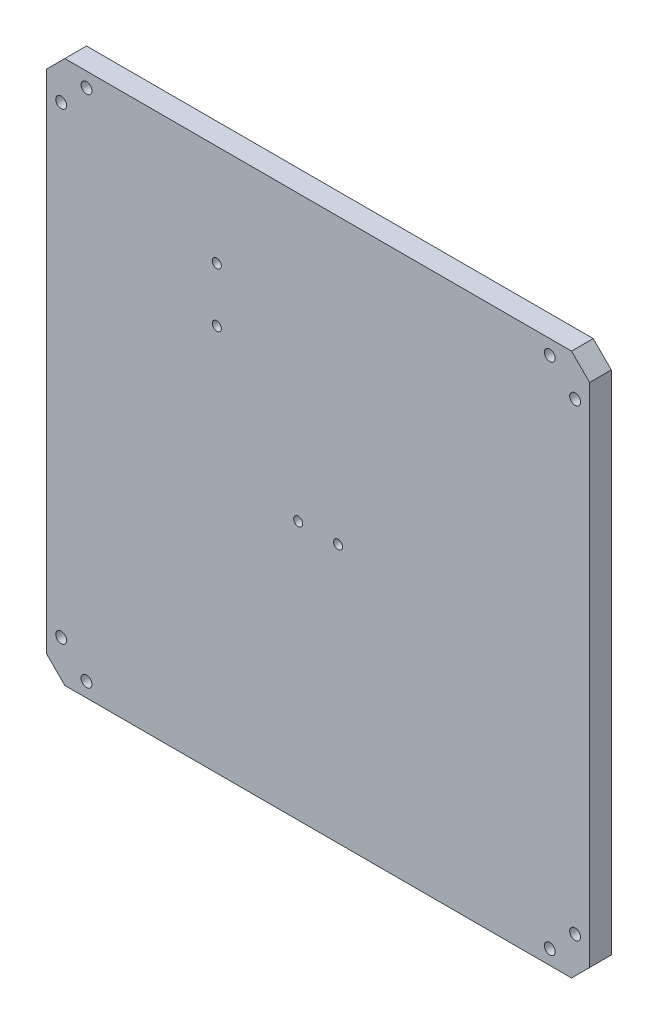
ISO-10303-21;
HEADER;
FILE_DESCRIPTION(('STEP AP214'),'2;1');
FILE_NAME('part.step','',(''),(''),'','','');
FILE_SCHEMA(('AUTOMOTIVE_DESIGN { 1 0 10303 214 1 1 1 1 }'));
ENDSEC;
DATA;
#1=APPLICATION_CONTEXT('core data for automotive mechanical design processes');
#2=APPLICATION_PROTOCOL_DEFINITION('international standard','automotive_design',2000,#1);
#3=PRODUCT_CONTEXT('',#1,'mechanical');
#4=PRODUCT('Part','Part','',(#3));
#5=PRODUCT_RELATED_PRODUCT_CATEGORY('part','',(#4));
#6=PRODUCT_DEFINITION_FORMATION('','',#4);
#7=PRODUCT_DEFINITION_CONTEXT('part definition',#1,'design');
#8=PRODUCT_DEFINITION('design','',#6,#7);
#9=PRODUCT_DEFINITION_SHAPE('','',#8);
#10=(LENGTH_UNIT() NAMED_UNIT(*) SI_UNIT(.MILLI.,.METRE.));
#11=(NAMED_UNIT(*) PLANE_ANGLE_UNIT() SI_UNIT($,.RADIAN.));
#12=(NAMED_UNIT(*) SI_UNIT($,.STERADIAN.) SOLID_ANGLE_UNIT());
#13=UNCERTAINTY_MEASURE_WITH_UNIT(LENGTH_MEASURE(1.E-05),#10,'distance_accuracy_value','');
#14=(GEOMETRIC_REPRESENTATION_CONTEXT(3) GLOBAL_UNCERTAINTY_ASSIGNED_CONTEXT((#13)) GLOBAL_UNIT_ASSIGNED_CONTEXT((#10,
#11,#12)) REPRESENTATION_CONTEXT('',''));
#15=CARTESIAN_POINT('',(0.,0.,0.));
#16=DIRECTION('',(0.,0.,1.));
#17=DIRECTION('',(1.,0.,0.));
#18=AXIS2_PLACEMENT_3D('',#15,#16,#17);
#19=CARTESIAN_POINT('',(-71.,-64.,-4.));
#20=DIRECTION('',(0.,0.,1.));
#21=DIRECTION('',(1.,0.,0.));
#22=AXIS2_PLACEMENT_3D('',#19,#20,#21);
#23=CYLINDRICAL_SURFACE('',#22,1.5);
#24=CARTESIAN_POINT('',(-71.,-64.,6.));
#25=DIRECTION('',(0.,0.,-1.));
#26=DIRECTION('',(-1.,0.,0.));
#27=AXIS2_PLACEMENT_3D('',#24,#25,#26);
#28=CIRCLE('',#27,1.5);
#29=CARTESIAN_POINT('',(-72.5,-64.,6.));
#30=VERTEX_POINT('',#29);
#31=EDGE_CURVE('E263',#30,#30,#28,.T.);
#32=ORIENTED_EDGE('',*,*,#31,.F.);
#33=EDGE_LOOP('',(#32));
#34=FACE_BOUND('',#33,.T.);
#35=CARTESIAN_POINT('',(-71.,-64.,3.2));
#36=DIRECTION('',(0.,0.,-1.));
#37=DIRECTION('',(-1.,0.,0.));
#38=AXIS2_PLACEMENT_3D('',#35,#36,#37);
#39=CIRCLE('',#38,1.5);
#40=CARTESIAN_POINT('',(-72.5,-64.,3.2));
#41=VERTEX_POINT('',#40);
#42=EDGE_CURVE('E217',#41,#41,#39,.T.);
#43=ORIENTED_EDGE('',*,*,#42,.T.);
#44=EDGE_LOOP('',(#43));
#45=FACE_BOUND('',#44,.T.);
#46=ADVANCED_FACE('F38',(#34,#45),#23,.F.);
#47=CARTESIAN_POINT('',(-64.,-71.,-4.));
#48=DIRECTION('',(0.,0.,1.));
#49=DIRECTION('',(1.,0.,0.));
#50=AXIS2_PLACEMENT_3D('',#47,#48,#49);
#51=CYLINDRICAL_SURFACE('',#50,1.5);
#52=CARTESIAN_POINT('',(-64.,-71.,6.));
#53=DIRECTION('',(0.,0.,-1.));
#54=DIRECTION('',(-1.,0.,0.));
#55=AXIS2_PLACEMENT_3D('',#52,#53,#54);
#56=CIRCLE('',#55,1.5);
#57=CARTESIAN_POINT('',(-65.5,-71.,6.));
#58=VERTEX_POINT('',#57);
#59=EDGE_CURVE('E204',#58,#58,#56,.T.);
#60=ORIENTED_EDGE('',*,*,#59,.F.);
#61=EDGE_LOOP('',(#60));
#62=FACE_BOUND('',#61,.T.);
#63=CARTESIAN_POINT('',(-64.,-71.,3.2));
#64=DIRECTION('',(0.,0.,-1.));
#65=DIRECTION('',(-1.,0.,0.));
#66=AXIS2_PLACEMENT_3D('',#63,#64,#65);
#67=CIRCLE('',#66,1.5);
#68=CARTESIAN_POINT('',(-65.5,-71.,3.2));
#69=VERTEX_POINT('',#68);
#70=EDGE_CURVE('E212',#69,#69,#67,.T.);
#71=ORIENTED_EDGE('',*,*,#70,.T.);
#72=EDGE_LOOP('',(#71));
#73=FACE_BOUND('',#72,.T.);
#74=ADVANCED_FACE('F346',(#62,#73),#51,.F.);
#75=CARTESIAN_POINT('',(71.,-64.,-4.));
#76=DIRECTION('',(0.,0.,1.));
#77=DIRECTION('',(1.,0.,0.));
#78=AXIS2_PLACEMENT_3D('',#75,#76,#77);
#79=CYLINDRICAL_SURFACE('',#78,1.5);
#80=CARTESIAN_POINT('',(71.,-64.,6.));
#81=DIRECTION('',(0.,0.,-1.));
#82=DIRECTION('',(1.,0.,0.));
#83=AXIS2_PLACEMENT_3D('',#80,#81,#82);
#84=CIRCLE('',#83,1.5);
#85=CARTESIAN_POINT('',(72.5,-64.,6.));
#86=VERTEX_POINT('',#85);
#87=EDGE_CURVE('E259',#86,#86,#84,.T.);
#88=ORIENTED_EDGE('',*,*,#87,.F.);
#89=EDGE_LOOP('',(#88));
#90=FACE_BOUND('',#89,.T.);
#91=CARTESIAN_POINT('',(71.,-64.,3.2));
#92=DIRECTION('',(0.,0.,-1.));
#93=DIRECTION('',(-1.,0.,0.));
#94=AXIS2_PLACEMENT_3D('',#91,#92,#93);
#95=CIRCLE('',#94,1.5);
#96=CARTESIAN_POINT('',(69.5,-64.,3.2));
#97=VERTEX_POINT('',#96);
#98=EDGE_CURVE('E206',#97,#97,#95,.T.);
#99=ORIENTED_EDGE('',*,*,#98,.T.);
#100=EDGE_LOOP('',(#99));
#101=FACE_BOUND('',#100,.T.);
#102=ADVANCED_FACE('F352',(#90,#101),#79,.F.);
#103=CARTESIAN_POINT('',(64.,-71.,-4.));
#104=DIRECTION('',(0.,0.,1.));
#105=DIRECTION('',(1.,0.,0.));
#106=AXIS2_PLACEMENT_3D('',#103,#104,#105);
#107=CYLINDRICAL_SURFACE('',#106,1.5);
#108=CARTESIAN_POINT('',(64.,-71.,6.));
#109=DIRECTION('',(0.,0.,-1.));
#110=DIRECTION('',(1.,0.,0.));
#111=AXIS2_PLACEMENT_3D('',#108,#109,#110);
#112=CIRCLE('',#111,1.5);
#113=CARTESIAN_POINT('',(65.5,-71.,6.));
#114=VERTEX_POINT('',#113);
#115=EDGE_CURVE('E262',#114,#114,#112,.T.);
#116=ORIENTED_EDGE('',*,*,#115,.F.);
#117=EDGE_LOOP('',(#116));
#118=FACE_BOUND('',#117,.T.);
#119=CARTESIAN_POINT('',(64.,-71.,3.2));
#120=DIRECTION('',(0.,0.,-1.));
#121=DIRECTION('',(-1.,0.,0.));
#122=AXIS2_PLACEMENT_3D('',#119,#120,#121);
#123=CIRCLE('',#122,1.5);
#124=CARTESIAN_POINT('',(62.5,-71.,3.2));
#125=VERTEX_POINT('',#124);
#126=EDGE_CURVE('E200',#125,#125,#123,.T.);
#127=ORIENTED_EDGE('',*,*,#126,.T.);
#128=EDGE_LOOP('',(#127));
#129=FACE_BOUND('',#128,.T.);
#130=ADVANCED_FACE('F359',(#118,#129),#107,.F.);
#131=CARTESIAN_POINT('',(71.,64.,-4.));
#132=DIRECTION('',(0.,0.,1.));
#133=DIRECTION('',(1.,0.,0.));
#134=AXIS2_PLACEMENT_3D('',#131,#132,#133);
#135=CYLINDRICAL_SURFACE('',#134,1.5);
#136=CARTESIAN_POINT('',(71.,64.,6.));
#137=DIRECTION('',(0.,0.,1.));
#138=DIRECTION('',(1.,0.,0.));
#139=AXIS2_PLACEMENT_3D('',#136,#137,#138);
#140=CIRCLE('',#139,1.5);
#141=CARTESIAN_POINT('',(72.5,64.,6.));
#142=VERTEX_POINT('',#141);
#143=EDGE_CURVE('E295',#142,#142,#140,.T.);
#144=ORIENTED_EDGE('',*,*,#143,.T.);
#145=EDGE_LOOP('',(#144));
#146=FACE_BOUND('',#145,.T.);
#147=CARTESIAN_POINT('',(71.,64.,3.2));
#148=DIRECTION('',(0.,0.,-1.));
#149=DIRECTION('',(-1.,0.,0.));
#150=AXIS2_PLACEMENT_3D('',#147,#148,#149);
#151=CIRCLE('',#150,1.5);
#152=CARTESIAN_POINT('',(69.5,64.,3.2));
#153=VERTEX_POINT('',#152);
#154=EDGE_CURVE('E194',#153,#153,#151,.F.);
#155=ORIENTED_EDGE('',*,*,#154,.F.);
#156=EDGE_LOOP('',(#155));
#157=FACE_BOUND('',#156,.T.);
#158=ADVANCED_FACE('F362',(#146,#157),#135,.F.);
#159=CARTESIAN_POINT('',(64.,71.,-4.));
#160=DIRECTION('',(0.,0.,1.));
#161=DIRECTION('',(1.,0.,0.));
#162=AXIS2_PLACEMENT_3D('',#159,#160,#161);
#163=CYLINDRICAL_SURFACE('',#162,1.5);
#164=CARTESIAN_POINT('',(64.,71.,6.));
#165=DIRECTION('',(0.,0.,1.));
#166=DIRECTION('',(1.,0.,0.));
#167=AXIS2_PLACEMENT_3D('',#164,#165,#166);
#168=CIRCLE('',#167,1.5);
#169=CARTESIAN_POINT('',(65.5,71.,6.));
#170=VERTEX_POINT('',#169);
#171=EDGE_CURVE('E298',#170,#170,#168,.T.);
#172=ORIENTED_EDGE('',*,*,#171,.T.);
#173=EDGE_LOOP('',(#172));
#174=FACE_BOUND('',#173,.T.);
#175=CARTESIAN_POINT('',(64.,71.,3.2));
#176=DIRECTION('',(0.,0.,-1.));
#177=DIRECTION('',(-1.,0.,0.));
#178=AXIS2_PLACEMENT_3D('',#175,#176,#177);
#179=CIRCLE('',#178,1.5);
#180=CARTESIAN_POINT('',(62.5,71.,3.2));
#181=VERTEX_POINT('',#180);
#182=EDGE_CURVE('E188',#181,#181,#179,.F.);
#183=ORIENTED_EDGE('',*,*,#182,.F.);
#184=EDGE_LOOP('',(#183));
#185=FACE_BOUND('',#184,.T.);
#186=ADVANCED_FACE('F399',(#174,#185),#163,.F.);
#187=CARTESIAN_POINT('',(-71.,64.,-4.));
#188=DIRECTION('',(0.,0.,1.));
#189=DIRECTION('',(1.,0.,0.));
#190=AXIS2_PLACEMENT_3D('',#187,#188,#189);
#191=CYLINDRICAL_SURFACE('',#190,1.5);
#192=CARTESIAN_POINT('',(-71.,64.,6.));
#193=DIRECTION('',(0.,0.,1.));
#194=DIRECTION('',(-1.,0.,0.));
#195=AXIS2_PLACEMENT_3D('',#192,#193,#194);
#196=CIRCLE('',#195,1.5);
#197=CARTESIAN_POINT('',(-72.5,64.,6.));
#198=VERTEX_POINT('',#197);
#199=EDGE_CURVE('E299',#198,#198,#196,.T.);
#200=ORIENTED_EDGE('',*,*,#199,.T.);
#201=EDGE_LOOP('',(#200));
#202=FACE_BOUND('',#201,.T.);
#203=CARTESIAN_POINT('',(-71.,64.,3.2));
#204=DIRECTION('',(0.,0.,-1.));
#205=DIRECTION('',(-1.,0.,0.));
#206=AXIS2_PLACEMENT_3D('',#203,#204,#205);
#207=CIRCLE('',#206,1.5);
#208=CARTESIAN_POINT('',(-72.5,64.,3.2));
#209=VERTEX_POINT('',#208);
#210=EDGE_CURVE('E182',#209,#209,#207,.F.);
#211=ORIENTED_EDGE('',*,*,#210,.F.);
#212=EDGE_LOOP('',(#211));
#213=FACE_BOUND('',#212,.T.);
#214=ADVANCED_FACE('F401',(#202,#213),#191,.F.);
#215=CARTESIAN_POINT('',(-64.,71.,-4.));
#216=DIRECTION('',(0.,0.,1.));
#217=DIRECTION('',(1.,0.,0.));
#218=AXIS2_PLACEMENT_3D('',#215,#216,#217);
#219=CYLINDRICAL_SURFACE('',#218,1.5);
#220=CARTESIAN_POINT('',(-64.,71.,6.));
#221=DIRECTION('',(0.,0.,1.));
#222=DIRECTION('',(-1.,0.,0.));
#223=AXIS2_PLACEMENT_3D('',#220,#221,#222);
#224=CIRCLE('',#223,1.5);
#225=CARTESIAN_POINT('',(-65.5,71.,6.));
#226=VERTEX_POINT('',#225);
#227=EDGE_CURVE('E180',#226,#226,#224,.T.);
#228=ORIENTED_EDGE('',*,*,#227,.T.);
#229=EDGE_LOOP('',(#228));
#230=FACE_BOUND('',#229,.T.);
#231=CARTESIAN_POINT('',(-64.,71.,3.2));
#232=DIRECTION('',(0.,0.,-1.));
#233=DIRECTION('',(-1.,0.,0.));
#234=AXIS2_PLACEMENT_3D('',#231,#232,#233);
#235=CIRCLE('',#234,1.5);
#236=CARTESIAN_POINT('',(-65.5,71.,3.2));
#237=VERTEX_POINT('',#236);
#238=EDGE_CURVE('E176',#237,#237,#235,.F.);
#239=ORIENTED_EDGE('',*,*,#238,.F.);
#240=EDGE_LOOP('',(#239));
#241=FACE_BOUND('',#240,.T.);
#242=ADVANCED_FACE('F343',(#230,#241),#219,.F.);
#243=CARTESIAN_POINT('',(-75.,-75.,6.));
#244=DIRECTION('',(1.,0.,0.));
#245=DIRECTION('',(0.,0.,-1.));
#246=AXIS2_PLACEMENT_3D('',#243,#244,#245);
#247=PLANE('',#246);
#248=DIRECTION('',(0.,-1.,0.));
#249=VECTOR('',#248,1.);
#250=CARTESIAN_POINT('',(-75.,-75.,0.));
#251=LINE('',#250,#249);
#252=CARTESIAN_POINT('',(-75.,70.,0.));
#253=VERTEX_POINT('',#252);
#254=CARTESIAN_POINT('',(-75.,-70.,0.));
#255=VERTEX_POINT('',#254);
#256=EDGE_CURVE('E142',#253,#255,#251,.T.);
#257=ORIENTED_EDGE('',*,*,#256,.T.);
#258=DIRECTION('',(0.,0.,1.));
#259=VECTOR('',#258,1.);
#260=CARTESIAN_POINT('',(-75.,-70.,6.));
#261=LINE('',#260,#259);
#262=CARTESIAN_POINT('',(-75.,-70.,6.));
#263=VERTEX_POINT('',#262);
#264=EDGE_CURVE('E172',#255,#263,#261,.T.);
#265=ORIENTED_EDGE('',*,*,#264,.T.);
#266=DIRECTION('',(0.,-1.,0.));
#267=VECTOR('',#266,1.);
#268=CARTESIAN_POINT('',(-75.,-75.,6.));
#269=LINE('',#268,#267);
#270=CARTESIAN_POINT('',(-75.,70.,6.));
#271=VERTEX_POINT('',#270);
#272=EDGE_CURVE('E139',#271,#263,#269,.T.);
#273=ORIENTED_EDGE('',*,*,#272,.F.);
#274=DIRECTION('',(0.,0.,-1.));
#275=VECTOR('',#274,1.);
#276=CARTESIAN_POINT('',(-75.,70.,6.));
#277=LINE('',#276,#275);
#278=EDGE_CURVE('E169',#271,#253,#277,.T.);
#279=ORIENTED_EDGE('',*,*,#278,.T.);
#280=EDGE_LOOP('',(#257,#265,#273,#279));
#281=FACE_BOUND('',#280,.T.);
#282=ADVANCED_FACE('F324',(#281),#247,.F.);
#283=CARTESIAN_POINT('',(75.,-75.,6.));
#284=DIRECTION('',(0.,1.,0.));
#285=DIRECTION('',(-1.,0.,0.));
#286=AXIS2_PLACEMENT_3D('',#283,#284,#285);
#287=PLANE('',#286);
#288=DIRECTION('',(1.,0.,0.));
#289=VECTOR('',#288,1.);
#290=CARTESIAN_POINT('',(75.,-75.,0.));
#291=LINE('',#290,#289);
#292=CARTESIAN_POINT('',(-70.0000000000001,-75.,0.));
#293=VERTEX_POINT('',#292);
#294=CARTESIAN_POINT('',(70.,-75.,0.));
#295=VERTEX_POINT('',#294);
#296=EDGE_CURVE('E133',#293,#295,#291,.T.);
#297=ORIENTED_EDGE('',*,*,#296,.T.);
#298=DIRECTION('',(0.,0.,1.));
#299=VECTOR('',#298,1.);
#300=CARTESIAN_POINT('',(70.,-75.,6.));
#301=LINE('',#300,#299);
#302=CARTESIAN_POINT('',(70.,-75.,6.));
#303=VERTEX_POINT('',#302);
#304=EDGE_CURVE('E110',#295,#303,#301,.T.);
#305=ORIENTED_EDGE('',*,*,#304,.T.);
#306=DIRECTION('',(1.,0.,0.));
#307=VECTOR('',#306,1.);
#308=CARTESIAN_POINT('',(75.,-75.,6.));
#309=LINE('',#308,#307);
#310=CARTESIAN_POINT('',(-70.0000000000001,-75.,6.));
#311=VERTEX_POINT('',#310);
#312=EDGE_CURVE('E310',#311,#303,#309,.T.);
#313=ORIENTED_EDGE('',*,*,#312,.F.);
#314=DIRECTION('',(0.,0.,-1.));
#315=VECTOR('',#314,1.);
#316=CARTESIAN_POINT('',(-70.0000000000001,-75.,6.));
#317=LINE('',#316,#315);
#318=EDGE_CURVE('E116',#311,#293,#317,.T.);
#319=ORIENTED_EDGE('',*,*,#318,.T.);
#320=EDGE_LOOP('',(#297,#305,#313,#319));
#321=FACE_BOUND('',#320,.T.);
#322=ADVANCED_FACE('F334',(#321),#287,.F.);
#323=CARTESIAN_POINT('',(75.,-75.,6.));
#324=DIRECTION('',(-1.,0.,0.));
#325=DIRECTION('',(0.,0.,1.));
#326=AXIS2_PLACEMENT_3D('',#323,#324,#325);
#327=PLANE('',#326);
#328=DIRECTION('',(0.,1.,0.));
#329=VECTOR('',#328,1.);
#330=CARTESIAN_POINT('',(75.,-75.,6.));
#331=LINE('',#330,#329);
#332=CARTESIAN_POINT('',(75.,-70.,6.));
#333=VERTEX_POINT('',#332);
#334=CARTESIAN_POINT('',(75.,70.,6.));
#335=VERTEX_POINT('',#334);
#336=EDGE_CURVE('E125',#333,#335,#331,.T.);
#337=ORIENTED_EDGE('',*,*,#336,.F.);
#338=DIRECTION('',(0.,0.,-1.));
#339=VECTOR('',#338,1.);
#340=CARTESIAN_POINT('',(75.,-70.,6.));
#341=LINE('',#340,#339);
#342=CARTESIAN_POINT('',(75.,-70.,0.));
#343=VERTEX_POINT('',#342);
#344=EDGE_CURVE('E109',#333,#343,#341,.T.);
#345=ORIENTED_EDGE('',*,*,#344,.T.);
#346=DIRECTION('',(0.,1.,0.));
#347=VECTOR('',#346,1.);
#348=CARTESIAN_POINT('',(75.,-75.,0.));
#349=LINE('',#348,#347);
#350=CARTESIAN_POINT('',(75.,70.,0.));
#351=VERTEX_POINT('',#350);
#352=EDGE_CURVE('E123',#343,#351,#349,.T.);
#353=ORIENTED_EDGE('',*,*,#352,.T.);
#354=DIRECTION('',(0.,0.,1.));
#355=VECTOR('',#354,1.);
#356=CARTESIAN_POINT('',(75.,70.,6.));
#357=LINE('',#356,#355);
#358=EDGE_CURVE('E127',#351,#335,#357,.T.);
#359=ORIENTED_EDGE('',*,*,#358,.T.);
#360=EDGE_LOOP('',(#337,#345,#353,#359));
#361=FACE_BOUND('',#360,.T.);
#362=ADVANCED_FACE('F122',(#361),#327,.F.);
#363=CARTESIAN_POINT('',(75.,75.,6.));
#364=DIRECTION('',(0.,-1.,0.));
#365=DIRECTION('',(1.,0.,0.));
#366=AXIS2_PLACEMENT_3D('',#363,#364,#365);
#367=PLANE('',#366);
#368=DIRECTION('',(-1.,0.,0.));
#369=VECTOR('',#368,1.);
#370=CARTESIAN_POINT('',(75.,75.,0.));
#371=LINE('',#370,#369);
#372=CARTESIAN_POINT('',(70.,75.,0.));
#373=VERTEX_POINT('',#372);
#374=CARTESIAN_POINT('',(-70.,75.,0.));
#375=VERTEX_POINT('',#374);
#376=EDGE_CURVE('E132',#373,#375,#371,.T.);
#377=ORIENTED_EDGE('',*,*,#376,.T.);
#378=DIRECTION('',(0.,0.,1.));
#379=VECTOR('',#378,1.);
#380=CARTESIAN_POINT('',(-70.,75.,6.));
#381=LINE('',#380,#379);
#382=CARTESIAN_POINT('',(-70.,75.,6.));
#383=VERTEX_POINT('',#382);
#384=EDGE_CURVE('E11',#375,#383,#381,.T.);
#385=ORIENTED_EDGE('',*,*,#384,.T.);
#386=DIRECTION('',(-1.,0.,0.));
#387=VECTOR('',#386,1.);
#388=CARTESIAN_POINT('',(75.,75.,6.));
#389=LINE('',#388,#387);
#390=CARTESIAN_POINT('',(70.,75.,6.));
#391=VERTEX_POINT('',#390);
#392=EDGE_CURVE('E146',#391,#383,#389,.T.);
#393=ORIENTED_EDGE('',*,*,#392,.F.);
#394=DIRECTION('',(0.,0.,-1.));
#395=VECTOR('',#394,1.);
#396=CARTESIAN_POINT('',(70.,75.,6.));
#397=LINE('',#396,#395);
#398=EDGE_CURVE('E47',#391,#373,#397,.T.);
#399=ORIENTED_EDGE('',*,*,#398,.T.);
#400=EDGE_LOOP('',(#377,#385,#393,#399));
#401=FACE_BOUND('',#400,.T.);
#402=ADVANCED_FACE('F341',(#401),#367,.F.);
#403=CARTESIAN_POINT('',(0.,0.,6.));
#404=DIRECTION('',(0.,0.,1.));
#405=DIRECTION('',(1.,0.,0.));
#406=AXIS2_PLACEMENT_3D('',#403,#404,#405);
#407=PLANE('',#406);
#408=CARTESIAN_POINT('',(-28.,47.,6.));
#409=DIRECTION('',(0.,0.,1.));
#410=DIRECTION('',(1.,0.,0.));
#411=AXIS2_PLACEMENT_3D('',#408,#409,#410);
#412=CIRCLE('',#411,1.24999999999999);
#413=CARTESIAN_POINT('',(-26.75,47.,6.));
#414=VERTEX_POINT('',#413);
#415=EDGE_CURVE('E747',#414,#414,#412,.T.);
#416=ORIENTED_EDGE('',*,*,#415,.F.);
#417=EDGE_LOOP('',(#416));
#418=FACE_BOUND('',#417,.T.);
#419=CARTESIAN_POINT('',(-28.,32.,6.));
#420=DIRECTION('',(0.,0.,1.));
#421=DIRECTION('',(1.,0.,0.));
#422=AXIS2_PLACEMENT_3D('',#419,#420,#421);
#423=CIRCLE('',#422,1.24999999999999);
#424=CARTESIAN_POINT('',(-26.75,32.,6.));
#425=VERTEX_POINT('',#424);
#426=EDGE_CURVE('E723',#425,#425,#423,.T.);
#427=ORIENTED_EDGE('',*,*,#426,.F.);
#428=EDGE_LOOP('',(#427));
#429=FACE_BOUND('',#428,.T.);
#430=CARTESIAN_POINT('',(-5.50000000000001,-3.49999999999997,6.));
#431=DIRECTION('',(0.,0.,1.));
#432=DIRECTION('',(1.,0.,0.));
#433=AXIS2_PLACEMENT_3D('',#430,#431,#432);
#434=CIRCLE('',#433,1.24999999999999);
#435=CARTESIAN_POINT('',(-4.25000000000002,-3.49999999999997,6.));
#436=VERTEX_POINT('',#435);
#437=EDGE_CURVE('E722',#436,#436,#434,.T.);
#438=ORIENTED_EDGE('',*,*,#437,.F.);
#439=EDGE_LOOP('',(#438));
#440=FACE_BOUND('',#439,.T.);
#441=CARTESIAN_POINT('',(5.49999999999999,-3.49999999999997,6.));
#442=DIRECTION('',(0.,0.,1.));
#443=DIRECTION('',(1.,0.,0.));
#444=AXIS2_PLACEMENT_3D('',#441,#442,#443);
#445=CIRCLE('',#444,1.24999999999999);
#446=CARTESIAN_POINT('',(6.74999999999998,-3.49999999999997,6.));
#447=VERTEX_POINT('',#446);
#448=EDGE_CURVE('E733',#447,#447,#445,.T.);
#449=ORIENTED_EDGE('',*,*,#448,.F.);
#450=EDGE_LOOP('',(#449));
#451=FACE_BOUND('',#450,.T.);
#452=ORIENTED_EDGE('',*,*,#87,.T.);
#453=EDGE_LOOP('',(#452));
#454=FACE_BOUND('',#453,.T.);
#455=ORIENTED_EDGE('',*,*,#31,.T.);
#456=EDGE_LOOP('',(#455));
#457=FACE_BOUND('',#456,.T.);
#458=ORIENTED_EDGE('',*,*,#59,.T.);
#459=EDGE_LOOP('',(#458));
#460=FACE_BOUND('',#459,.T.);
#461=ORIENTED_EDGE('',*,*,#115,.T.);
#462=EDGE_LOOP('',(#461));
#463=FACE_BOUND('',#462,.T.);
#464=ORIENTED_EDGE('',*,*,#143,.F.);
#465=EDGE_LOOP('',(#464));
#466=FACE_BOUND('',#465,.T.);
#467=ORIENTED_EDGE('',*,*,#199,.F.);
#468=EDGE_LOOP('',(#467));
#469=FACE_BOUND('',#468,.T.);
#470=ORIENTED_EDGE('',*,*,#227,.F.);
#471=EDGE_LOOP('',(#470));
#472=FACE_BOUND('',#471,.T.);
#473=ORIENTED_EDGE('',*,*,#171,.F.);
#474=EDGE_LOOP('',(#473));
#475=FACE_BOUND('',#474,.T.);
#476=ORIENTED_EDGE('',*,*,#312,.T.);
#477=DIRECTION('',(-0.707106781186549,-0.707106781186546,0.));
#478=VECTOR('',#477,1.);
#479=CARTESIAN_POINT('',(72.4999999999998,-72.5000000000002,6.));
#480=LINE('',#479,#478);
#481=EDGE_CURVE('E167',#303,#333,#480,.F.);
#482=ORIENTED_EDGE('',*,*,#481,.T.);
#483=ORIENTED_EDGE('',*,*,#336,.T.);
#484=DIRECTION('',(0.707106781186548,-0.707106781186548,0.));
#485=VECTOR('',#484,1.);
#486=CARTESIAN_POINT('',(72.5,72.5,6.));
#487=LINE('',#486,#485);
#488=EDGE_CURVE('E60',#335,#391,#487,.F.);
#489=ORIENTED_EDGE('',*,*,#488,.T.);
#490=ORIENTED_EDGE('',*,*,#392,.T.);
#491=DIRECTION('',(0.707106781186549,0.707106781186547,0.));
#492=VECTOR('',#491,1.);
#493=CARTESIAN_POINT('',(-72.4999999999999,72.5000000000001,6.));
#494=LINE('',#493,#492);
#495=EDGE_CURVE('E161',#383,#271,#494,.F.);
#496=ORIENTED_EDGE('',*,*,#495,.T.);
#497=ORIENTED_EDGE('',*,*,#272,.T.);
#498=DIRECTION('',(-0.707106781186548,0.707106781186548,0.));
#499=VECTOR('',#498,1.);
#500=CARTESIAN_POINT('',(-72.5,-72.5,6.));
#501=LINE('',#500,#499);
#502=EDGE_CURVE('E164',#263,#311,#501,.F.);
#503=ORIENTED_EDGE('',*,*,#502,.T.);
#504=EDGE_LOOP('',(#476,#482,#483,#489,#490,#496,#497,#503));
#505=FACE_BOUND('',#504,.T.);
#506=ADVANCED_FACE('F332',(#418,#429,#440,#451,#454,#457,#460,#463,#466,#469,#472,#475,#505),
#407,.T.);
#507=CARTESIAN_POINT('',(0.,0.,0.));
#508=DIRECTION('',(0.,0.,1.));
#509=DIRECTION('',(1.,0.,0.));
#510=AXIS2_PLACEMENT_3D('',#507,#508,#509);
#511=PLANE('',#510);
#512=CARTESIAN_POINT('',(-28.,47.,0.));
#513=DIRECTION('',(0.,0.,1.));
#514=DIRECTION('',(1.,0.,0.));
#515=AXIS2_PLACEMENT_3D('',#512,#513,#514);
#516=CIRCLE('',#515,1.24999999999999);
#517=CARTESIAN_POINT('',(-26.75,47.,0.));
#518=VERTEX_POINT('',#517);
#519=EDGE_CURVE('E42',#518,#518,#516,.T.);
#520=ORIENTED_EDGE('',*,*,#519,.T.);
#521=EDGE_LOOP('',(#520));
#522=FACE_BOUND('',#521,.T.);
#523=CARTESIAN_POINT('',(-28.,32.,0.));
#524=DIRECTION('',(0.,0.,1.));
#525=DIRECTION('',(1.,0.,0.));
#526=AXIS2_PLACEMENT_3D('',#523,#524,#525);
#527=CIRCLE('',#526,1.24999999999999);
#528=CARTESIAN_POINT('',(-26.75,32.,0.));
#529=VERTEX_POINT('',#528);
#530=EDGE_CURVE('E718',#529,#529,#527,.T.);
#531=ORIENTED_EDGE('',*,*,#530,.T.);
#532=EDGE_LOOP('',(#531));
#533=FACE_BOUND('',#532,.T.);
#534=CARTESIAN_POINT('',(-5.50000000000001,-3.49999999999997,0.));
#535=DIRECTION('',(0.,0.,1.));
#536=DIRECTION('',(1.,0.,0.));
#537=AXIS2_PLACEMENT_3D('',#534,#535,#536);
#538=CIRCLE('',#537,1.24999999999999);
#539=CARTESIAN_POINT('',(-4.25000000000003,-3.49999999999997,0.));
#540=VERTEX_POINT('',#539);
#541=EDGE_CURVE('E730',#540,#540,#538,.T.);
#542=ORIENTED_EDGE('',*,*,#541,.T.);
#543=EDGE_LOOP('',(#542));
#544=FACE_BOUND('',#543,.T.);
#545=CARTESIAN_POINT('',(5.49999999999999,-3.49999999999997,0.));
#546=DIRECTION('',(0.,0.,1.));
#547=DIRECTION('',(1.,0.,0.));
#548=AXIS2_PLACEMENT_3D('',#545,#546,#547);
#549=CIRCLE('',#548,1.24999999999999);
#550=CARTESIAN_POINT('',(6.74999999999997,-3.49999999999997,0.));
#551=VERTEX_POINT('',#550);
#552=EDGE_CURVE('E239',#551,#551,#549,.T.);
#553=ORIENTED_EDGE('',*,*,#552,.T.);
#554=EDGE_LOOP('',(#553));
#555=FACE_BOUND('',#554,.T.);
#556=CARTESIAN_POINT('',(-71.,-64.,0.));
#557=DIRECTION('',(0.,0.,1.));
#558=DIRECTION('',(-1.,0.,0.));
#559=AXIS2_PLACEMENT_3D('',#556,#557,#558);
#560=CIRCLE('',#559,2.85);
#561=CARTESIAN_POINT('',(-73.85,-64.,0.));
#562=VERTEX_POINT('',#561);
#563=EDGE_CURVE('E231',#562,#562,#560,.T.);
#564=ORIENTED_EDGE('',*,*,#563,.T.);
#565=EDGE_LOOP('',(#564));
#566=FACE_BOUND('',#565,.T.);
#567=CARTESIAN_POINT('',(-64.,-71.,0.));
#568=DIRECTION('',(0.,0.,1.));
#569=DIRECTION('',(-1.,0.,0.));
#570=AXIS2_PLACEMENT_3D('',#567,#568,#569);
#571=CIRCLE('',#570,2.85);
#572=CARTESIAN_POINT('',(-66.85,-71.,0.));
#573=VERTEX_POINT('',#572);
#574=EDGE_CURVE('E220',#573,#573,#571,.T.);
#575=ORIENTED_EDGE('',*,*,#574,.T.);
#576=EDGE_LOOP('',(#575));
#577=FACE_BOUND('',#576,.T.);
#578=CARTESIAN_POINT('',(71.,-64.,0.));
#579=DIRECTION('',(0.,0.,-1.));
#580=DIRECTION('',(1.,0.,0.));
#581=AXIS2_PLACEMENT_3D('',#578,#579,#580);
#582=CIRCLE('',#581,2.85);
#583=CARTESIAN_POINT('',(73.85,-64.,0.));
#584=VERTEX_POINT('',#583);
#585=EDGE_CURVE('E215',#584,#584,#582,.T.);
#586=ORIENTED_EDGE('',*,*,#585,.F.);
#587=EDGE_LOOP('',(#586));
#588=FACE_BOUND('',#587,.T.);
#589=CARTESIAN_POINT('',(64.,-71.,0.));
#590=DIRECTION('',(0.,0.,-1.));
#591=DIRECTION('',(1.,0.,0.));
#592=AXIS2_PLACEMENT_3D('',#589,#590,#591);
#593=CIRCLE('',#592,2.85);
#594=CARTESIAN_POINT('',(66.85,-71.,0.));
#595=VERTEX_POINT('',#594);
#596=EDGE_CURVE('E210',#595,#595,#593,.T.);
#597=ORIENTED_EDGE('',*,*,#596,.F.);
#598=EDGE_LOOP('',(#597));
#599=FACE_BOUND('',#598,.T.);
#600=CARTESIAN_POINT('',(71.,64.,0.));
#601=DIRECTION('',(0.,0.,1.));
#602=DIRECTION('',(1.,0.,0.));
#603=AXIS2_PLACEMENT_3D('',#600,#601,#602);
#604=CIRCLE('',#603,2.85);
#605=CARTESIAN_POINT('',(73.85,64.,0.));
#606=VERTEX_POINT('',#605);
#607=EDGE_CURVE('E271',#606,#606,#604,.T.);
#608=ORIENTED_EDGE('',*,*,#607,.T.);
#609=EDGE_LOOP('',(#608));
#610=FACE_BOUND('',#609,.T.);
#611=CARTESIAN_POINT('',(64.,71.,0.));
#612=DIRECTION('',(0.,0.,1.));
#613=DIRECTION('',(1.,0.,0.));
#614=AXIS2_PLACEMENT_3D('',#611,#612,#613);
#615=CIRCLE('',#614,2.85);
#616=CARTESIAN_POINT('',(66.85,71.,0.));
#617=VERTEX_POINT('',#616);
#618=EDGE_CURVE('E198',#617,#617,#615,.T.);
#619=ORIENTED_EDGE('',*,*,#618,.T.);
#620=EDGE_LOOP('',(#619));
#621=FACE_BOUND('',#620,.T.);
#622=CARTESIAN_POINT('',(-71.,64.,0.));
#623=DIRECTION('',(0.,0.,-1.));
#624=DIRECTION('',(-1.,0.,0.));
#625=AXIS2_PLACEMENT_3D('',#622,#623,#624);
#626=CIRCLE('',#625,2.85);
#627=CARTESIAN_POINT('',(-73.85,64.,0.));
#628=VERTEX_POINT('',#627);
#629=EDGE_CURVE('E192',#628,#628,#626,.T.);
#630=ORIENTED_EDGE('',*,*,#629,.F.);
#631=EDGE_LOOP('',(#630));
#632=FACE_BOUND('',#631,.T.);
#633=CARTESIAN_POINT('',(-64.,71.,0.));
#634=DIRECTION('',(0.,0.,-1.));
#635=DIRECTION('',(-1.,0.,0.));
#636=AXIS2_PLACEMENT_3D('',#633,#634,#635);
#637=CIRCLE('',#636,2.85);
#638=CARTESIAN_POINT('',(-66.85,71.,0.));
#639=VERTEX_POINT('',#638);
#640=EDGE_CURVE('E186',#639,#639,#637,.T.);
#641=ORIENTED_EDGE('',*,*,#640,.F.);
#642=EDGE_LOOP('',(#641));
#643=FACE_BOUND('',#642,.T.);
#644=ORIENTED_EDGE('',*,*,#352,.F.);
#645=DIRECTION('',(0.707106781186549,0.707106781186546,0.));
#646=VECTOR('',#645,1.);
#647=CARTESIAN_POINT('',(75.,-70.,0.));
#648=LINE('',#647,#646);
#649=EDGE_CURVE('E105',#343,#295,#648,.F.);
#650=ORIENTED_EDGE('',*,*,#649,.T.);
#651=ORIENTED_EDGE('',*,*,#296,.F.);
#652=DIRECTION('',(0.707106781186548,-0.707106781186548,0.));
#653=VECTOR('',#652,1.);
#654=CARTESIAN_POINT('',(-70.0000000000001,-75.,0.));
#655=LINE('',#654,#653);
#656=EDGE_CURVE('E117',#293,#255,#655,.F.);
#657=ORIENTED_EDGE('',*,*,#656,.T.);
#658=ORIENTED_EDGE('',*,*,#256,.F.);
#659=DIRECTION('',(-0.707106781186549,-0.707106781186547,0.));
#660=VECTOR('',#659,1.);
#661=CARTESIAN_POINT('',(-75.,70.,0.));
#662=LINE('',#661,#660);
#663=EDGE_CURVE('E150',#253,#375,#662,.F.);
#664=ORIENTED_EDGE('',*,*,#663,.T.);
#665=ORIENTED_EDGE('',*,*,#376,.F.);
#666=DIRECTION('',(-0.707106781186548,0.707106781186548,0.));
#667=VECTOR('',#666,1.);
#668=CARTESIAN_POINT('',(70.,75.,0.));
#669=LINE('',#668,#667);
#670=EDGE_CURVE('E126',#373,#351,#669,.F.);
#671=ORIENTED_EDGE('',*,*,#670,.T.);
#672=EDGE_LOOP('',(#644,#650,#651,#657,#658,#664,#665,#671));
#673=FACE_BOUND('',#672,.T.);
#674=ADVANCED_FACE('F129',(#522,#533,#544,#555,#566,#577,#588,#599,#610,#621,#632,#643,#673),
#511,.F.);
#675=CARTESIAN_POINT('',(75.,-70.,6.));
#676=DIRECTION('',(-0.707106781186546,0.707106781186549,0.));
#677=DIRECTION('',(0.,0.,-1.));
#678=AXIS2_PLACEMENT_3D('',#675,#676,#677);
#679=PLANE('',#678);
#680=ORIENTED_EDGE('',*,*,#481,.F.);
#681=ORIENTED_EDGE('',*,*,#304,.F.);
#682=ORIENTED_EDGE('',*,*,#649,.F.);
#683=ORIENTED_EDGE('',*,*,#344,.F.);
#684=EDGE_LOOP('',(#680,#681,#682,#683));
#685=FACE_BOUND('',#684,.T.);
#686=ADVANCED_FACE('F108',(#685),#679,.F.);
#687=CARTESIAN_POINT('',(-70.0000000000001,-75.,6.));
#688=DIRECTION('',(0.707106781186547,0.707106781186547,0.));
#689=DIRECTION('',(0.,0.,-1.));
#690=AXIS2_PLACEMENT_3D('',#687,#688,#689);
#691=PLANE('',#690);
#692=ORIENTED_EDGE('',*,*,#502,.F.);
#693=ORIENTED_EDGE('',*,*,#264,.F.);
#694=ORIENTED_EDGE('',*,*,#656,.F.);
#695=ORIENTED_EDGE('',*,*,#318,.F.);
#696=EDGE_LOOP('',(#692,#693,#694,#695));
#697=FACE_BOUND('',#696,.T.);
#698=ADVANCED_FACE('F329',(#697),#691,.F.);
#699=CARTESIAN_POINT('',(-75.,70.,6.));
#700=DIRECTION('',(0.707106781186546,-0.707106781186548,0.));
#701=DIRECTION('',(0.,0.,-1.));
#702=AXIS2_PLACEMENT_3D('',#699,#700,#701);
#703=PLANE('',#702);
#704=ORIENTED_EDGE('',*,*,#495,.F.);
#705=ORIENTED_EDGE('',*,*,#384,.F.);
#706=ORIENTED_EDGE('',*,*,#663,.F.);
#707=ORIENTED_EDGE('',*,*,#278,.F.);
#708=EDGE_LOOP('',(#704,#705,#706,#707));
#709=FACE_BOUND('',#708,.T.);
#710=ADVANCED_FACE('F422',(#709),#703,.F.);
#711=CARTESIAN_POINT('',(70.,75.,6.));
#712=DIRECTION('',(-0.707106781186547,-0.707106781186547,0.));
#713=DIRECTION('',(0.,0.,-1.));
#714=AXIS2_PLACEMENT_3D('',#711,#712,#713);
#715=PLANE('',#714);
#716=ORIENTED_EDGE('',*,*,#488,.F.);
#717=ORIENTED_EDGE('',*,*,#358,.F.);
#718=ORIENTED_EDGE('',*,*,#670,.F.);
#719=ORIENTED_EDGE('',*,*,#398,.F.);
#720=EDGE_LOOP('',(#716,#717,#718,#719));
#721=FACE_BOUND('',#720,.T.);
#722=ADVANCED_FACE('F40',(#721),#715,.F.);
#723=CARTESIAN_POINT('',(-64.,71.,3.2));
#724=DIRECTION('',(0.,0.,-1.));
#725=DIRECTION('',(-1.,0.,0.));
#726=AXIS2_PLACEMENT_3D('',#723,#724,#725);
#727=PLANE('',#726);
#728=CARTESIAN_POINT('',(-64.,71.,3.2));
#729=DIRECTION('',(0.,0.,-1.));
#730=DIRECTION('',(-1.,0.,0.));
#731=AXIS2_PLACEMENT_3D('',#728,#729,#730);
#732=CIRCLE('',#731,2.85);
#733=CARTESIAN_POINT('',(-66.85,71.,3.2));
#734=VERTEX_POINT('',#733);
#735=EDGE_CURVE('E181',#734,#734,#732,.T.);
#736=ORIENTED_EDGE('',*,*,#735,.T.);
#737=EDGE_LOOP('',(#736));
#738=FACE_BOUND('',#737,.T.);
#739=ORIENTED_EDGE('',*,*,#238,.T.);
#740=EDGE_LOOP('',(#739));
#741=FACE_BOUND('',#740,.T.);
#742=ADVANCED_FACE('F390',(#738,#741),#727,.T.);
#743=CARTESIAN_POINT('',(-64.,71.,3.2));
#744=DIRECTION('',(0.,0.,-1.));
#745=DIRECTION('',(-1.,0.,0.));
#746=AXIS2_PLACEMENT_3D('',#743,#744,#745);
#747=CYLINDRICAL_SURFACE('',#746,2.85);
#748=ORIENTED_EDGE('',*,*,#735,.F.);
#749=EDGE_LOOP('',(#748));
#750=FACE_BOUND('',#749,.T.);
#751=ORIENTED_EDGE('',*,*,#640,.T.);
#752=EDGE_LOOP('',(#751));
#753=FACE_BOUND('',#752,.T.);
#754=ADVANCED_FACE('F385',(#750,#753),#747,.F.);
#755=CARTESIAN_POINT('',(-71.,64.,3.2));
#756=DIRECTION('',(0.,0.,-1.));
#757=DIRECTION('',(-1.,0.,0.));
#758=AXIS2_PLACEMENT_3D('',#755,#756,#757);
#759=PLANE('',#758);
#760=CARTESIAN_POINT('',(-71.,64.,3.2));
#761=DIRECTION('',(0.,0.,-1.));
#762=DIRECTION('',(-1.,0.,0.));
#763=AXIS2_PLACEMENT_3D('',#760,#761,#762);
#764=CIRCLE('',#763,2.85);
#765=CARTESIAN_POINT('',(-73.85,64.,3.2));
#766=VERTEX_POINT('',#765);
#767=EDGE_CURVE('E187',#766,#766,#764,.T.);
#768=ORIENTED_EDGE('',*,*,#767,.T.);
#769=EDGE_LOOP('',(#768));
#770=FACE_BOUND('',#769,.T.);
#771=ORIENTED_EDGE('',*,*,#210,.T.);
#772=EDGE_LOOP('',(#771));
#773=FACE_BOUND('',#772,.T.);
#774=ADVANCED_FACE('F382',(#770,#773),#759,.T.);
#775=CARTESIAN_POINT('',(-71.,64.,3.2));
#776=DIRECTION('',(0.,0.,-1.));
#777=DIRECTION('',(-1.,0.,0.));
#778=AXIS2_PLACEMENT_3D('',#775,#776,#777);
#779=CYLINDRICAL_SURFACE('',#778,2.85);
#780=ORIENTED_EDGE('',*,*,#767,.F.);
#781=EDGE_LOOP('',(#780));
#782=FACE_BOUND('',#781,.T.);
#783=ORIENTED_EDGE('',*,*,#629,.T.);
#784=EDGE_LOOP('',(#783));
#785=FACE_BOUND('',#784,.T.);
#786=ADVANCED_FACE('F377',(#782,#785),#779,.F.);
#787=CARTESIAN_POINT('',(64.,71.,3.2));
#788=DIRECTION('',(0.,0.,-1.));
#789=DIRECTION('',(1.,0.,0.));
#790=AXIS2_PLACEMENT_3D('',#787,#788,#789);
#791=PLANE('',#790);
#792=CARTESIAN_POINT('',(64.,71.,3.2));
#793=DIRECTION('',(0.,0.,1.));
#794=DIRECTION('',(1.,0.,0.));
#795=AXIS2_PLACEMENT_3D('',#792,#793,#794);
#796=CIRCLE('',#795,2.85);
#797=CARTESIAN_POINT('',(66.85,71.,3.2));
#798=VERTEX_POINT('',#797);
#799=EDGE_CURVE('E193',#798,#798,#796,.T.);
#800=ORIENTED_EDGE('',*,*,#799,.F.);
#801=EDGE_LOOP('',(#800));
#802=FACE_BOUND('',#801,.T.);
#803=ORIENTED_EDGE('',*,*,#182,.T.);
#804=EDGE_LOOP('',(#803));
#805=FACE_BOUND('',#804,.T.);
#806=ADVANCED_FACE('F374',(#802,#805),#791,.T.);
#807=CARTESIAN_POINT('',(64.,71.,3.2));
#808=DIRECTION('',(0.,0.,-1.));
#809=DIRECTION('',(-1.,0.,0.));
#810=AXIS2_PLACEMENT_3D('',#807,#808,#809);
#811=CYLINDRICAL_SURFACE('',#810,2.85);
#812=ORIENTED_EDGE('',*,*,#799,.T.);
#813=EDGE_LOOP('',(#812));
#814=FACE_BOUND('',#813,.T.);
#815=ORIENTED_EDGE('',*,*,#618,.F.);
#816=EDGE_LOOP('',(#815));
#817=FACE_BOUND('',#816,.T.);
#818=ADVANCED_FACE('F368',(#814,#817),#811,.F.);
#819=CARTESIAN_POINT('',(71.,64.,3.2));
#820=DIRECTION('',(0.,0.,-1.));
#821=DIRECTION('',(1.,0.,0.));
#822=AXIS2_PLACEMENT_3D('',#819,#820,#821);
#823=PLANE('',#822);
#824=CARTESIAN_POINT('',(71.,64.,3.2));
#825=DIRECTION('',(0.,0.,1.));
#826=DIRECTION('',(1.,0.,0.));
#827=AXIS2_PLACEMENT_3D('',#824,#825,#826);
#828=CIRCLE('',#827,2.85);
#829=CARTESIAN_POINT('',(73.85,64.,3.2));
#830=VERTEX_POINT('',#829);
#831=EDGE_CURVE('E199',#830,#830,#828,.T.);
#832=ORIENTED_EDGE('',*,*,#831,.F.);
#833=EDGE_LOOP('',(#832));
#834=FACE_BOUND('',#833,.T.);
#835=ORIENTED_EDGE('',*,*,#154,.T.);
#836=EDGE_LOOP('',(#835));
#837=FACE_BOUND('',#836,.T.);
#838=ADVANCED_FACE('F364',(#834,#837),#823,.T.);
#839=CARTESIAN_POINT('',(71.,64.,3.2));
#840=DIRECTION('',(0.,0.,-1.));
#841=DIRECTION('',(-1.,0.,0.));
#842=AXIS2_PLACEMENT_3D('',#839,#840,#841);
#843=CYLINDRICAL_SURFACE('',#842,2.85);
#844=ORIENTED_EDGE('',*,*,#831,.T.);
#845=EDGE_LOOP('',(#844));
#846=FACE_BOUND('',#845,.T.);
#847=ORIENTED_EDGE('',*,*,#607,.F.);
#848=EDGE_LOOP('',(#847));
#849=FACE_BOUND('',#848,.T.);
#850=ADVANCED_FACE('F367',(#846,#849),#843,.F.);
#851=CARTESIAN_POINT('',(64.,-71.,3.2));
#852=DIRECTION('',(0.,0.,-1.));
#853=DIRECTION('',(-1.,0.,0.));
#854=AXIS2_PLACEMENT_3D('',#851,#852,#853);
#855=CYLINDRICAL_SURFACE('',#854,2.85);
#856=CARTESIAN_POINT('',(64.,-71.,3.2));
#857=DIRECTION('',(0.,0.,-1.));
#858=DIRECTION('',(1.,0.,0.));
#859=AXIS2_PLACEMENT_3D('',#856,#857,#858);
#860=CIRCLE('',#859,2.85);
#861=CARTESIAN_POINT('',(66.85,-71.,3.2));
#862=VERTEX_POINT('',#861);
#863=EDGE_CURVE('E205',#862,#862,#860,.T.);
#864=ORIENTED_EDGE('',*,*,#863,.F.);
#865=EDGE_LOOP('',(#864));
#866=FACE_BOUND('',#865,.T.);
#867=ORIENTED_EDGE('',*,*,#596,.T.);
#868=EDGE_LOOP('',(#867));
#869=FACE_BOUND('',#868,.T.);
#870=ADVANCED_FACE('F372',(#866,#869),#855,.F.);
#871=CARTESIAN_POINT('',(64.,-71.,3.2));
#872=DIRECTION('',(0.,0.,-1.));
#873=DIRECTION('',(1.,0.,0.));
#874=AXIS2_PLACEMENT_3D('',#871,#872,#873);
#875=PLANE('',#874);
#876=ORIENTED_EDGE('',*,*,#126,.F.);
#877=EDGE_LOOP('',(#876));
#878=FACE_BOUND('',#877,.T.);
#879=ORIENTED_EDGE('',*,*,#863,.T.);
#880=EDGE_LOOP('',(#879));
#881=FACE_BOUND('',#880,.T.);
#882=ADVANCED_FACE('F581',(#878,#881),#875,.T.);
#883=CARTESIAN_POINT('',(71.,-64.,3.2));
#884=DIRECTION('',(0.,0.,-1.));
#885=DIRECTION('',(-1.,0.,0.));
#886=AXIS2_PLACEMENT_3D('',#883,#884,#885);
#887=CYLINDRICAL_SURFACE('',#886,2.85);
#888=CARTESIAN_POINT('',(71.,-64.,3.2));
#889=DIRECTION('',(0.,0.,-1.));
#890=DIRECTION('',(1.,0.,0.));
#891=AXIS2_PLACEMENT_3D('',#888,#889,#890);
#892=CIRCLE('',#891,2.85);
#893=CARTESIAN_POINT('',(73.85,-64.,3.2));
#894=VERTEX_POINT('',#893);
#895=EDGE_CURVE('E211',#894,#894,#892,.T.);
#896=ORIENTED_EDGE('',*,*,#895,.F.);
#897=EDGE_LOOP('',(#896));
#898=FACE_BOUND('',#897,.T.);
#899=ORIENTED_EDGE('',*,*,#585,.T.);
#900=EDGE_LOOP('',(#899));
#901=FACE_BOUND('',#900,.T.);
#902=ADVANCED_FACE('F590',(#898,#901),#887,.F.);
#903=CARTESIAN_POINT('',(71.,-64.,3.2));
#904=DIRECTION('',(0.,0.,-1.));
#905=DIRECTION('',(1.,0.,0.));
#906=AXIS2_PLACEMENT_3D('',#903,#904,#905);
#907=PLANE('',#906);
#908=ORIENTED_EDGE('',*,*,#98,.F.);
#909=EDGE_LOOP('',(#908));
#910=FACE_BOUND('',#909,.T.);
#911=ORIENTED_EDGE('',*,*,#895,.T.);
#912=EDGE_LOOP('',(#911));
#913=FACE_BOUND('',#912,.T.);
#914=ADVANCED_FACE('F600',(#910,#913),#907,.T.);
#915=CARTESIAN_POINT('',(-64.,-71.,3.2));
#916=DIRECTION('',(0.,0.,-1.));
#917=DIRECTION('',(-1.,0.,0.));
#918=AXIS2_PLACEMENT_3D('',#915,#916,#917);
#919=CYLINDRICAL_SURFACE('',#918,2.85);
#920=CARTESIAN_POINT('',(-64.,-71.,3.2));
#921=DIRECTION('',(0.,0.,1.));
#922=DIRECTION('',(-1.,0.,0.));
#923=AXIS2_PLACEMENT_3D('',#920,#921,#922);
#924=CIRCLE('',#923,2.85);
#925=CARTESIAN_POINT('',(-66.85,-71.,3.2));
#926=VERTEX_POINT('',#925);
#927=EDGE_CURVE('E216',#926,#926,#924,.T.);
#928=ORIENTED_EDGE('',*,*,#927,.T.);
#929=EDGE_LOOP('',(#928));
#930=FACE_BOUND('',#929,.T.);
#931=ORIENTED_EDGE('',*,*,#574,.F.);
#932=EDGE_LOOP('',(#931));
#933=FACE_BOUND('',#932,.T.);
#934=ADVANCED_FACE('F611',(#930,#933),#919,.F.);
#935=CARTESIAN_POINT('',(-64.,-71.,3.2));
#936=DIRECTION('',(0.,0.,-1.));
#937=DIRECTION('',(-1.,0.,0.));
#938=AXIS2_PLACEMENT_3D('',#935,#936,#937);
#939=PLANE('',#938);
#940=ORIENTED_EDGE('',*,*,#70,.F.);
#941=EDGE_LOOP('',(#940));
#942=FACE_BOUND('',#941,.T.);
#943=ORIENTED_EDGE('',*,*,#927,.F.);
#944=EDGE_LOOP('',(#943));
#945=FACE_BOUND('',#944,.T.);
#946=ADVANCED_FACE('F621',(#942,#945),#939,.T.);
#947=CARTESIAN_POINT('',(-71.,-64.,3.2));
#948=DIRECTION('',(0.,0.,-1.));
#949=DIRECTION('',(-1.,0.,0.));
#950=AXIS2_PLACEMENT_3D('',#947,#948,#949);
#951=CYLINDRICAL_SURFACE('',#950,2.85);
#952=CARTESIAN_POINT('',(-71.,-64.,3.2));
#953=DIRECTION('',(0.,0.,1.));
#954=DIRECTION('',(-1.,0.,0.));
#955=AXIS2_PLACEMENT_3D('',#952,#953,#954);
#956=CIRCLE('',#955,2.85);
#957=CARTESIAN_POINT('',(-73.85,-64.,3.2));
#958=VERTEX_POINT('',#957);
#959=EDGE_CURVE('E221',#958,#958,#956,.T.);
#960=ORIENTED_EDGE('',*,*,#959,.T.);
#961=EDGE_LOOP('',(#960));
#962=FACE_BOUND('',#961,.T.);
#963=ORIENTED_EDGE('',*,*,#563,.F.);
#964=EDGE_LOOP('',(#963));
#965=FACE_BOUND('',#964,.T.);
#966=ADVANCED_FACE('F631',(#962,#965),#951,.F.);
#967=CARTESIAN_POINT('',(-71.,-64.,3.2));
#968=DIRECTION('',(0.,0.,-1.));
#969=DIRECTION('',(-1.,0.,0.));
#970=AXIS2_PLACEMENT_3D('',#967,#968,#969);
#971=PLANE('',#970);
#972=ORIENTED_EDGE('',*,*,#42,.F.);
#973=EDGE_LOOP('',(#972));
#974=FACE_BOUND('',#973,.T.);
#975=ORIENTED_EDGE('',*,*,#959,.F.);
#976=EDGE_LOOP('',(#975));
#977=FACE_BOUND('',#976,.T.);
#978=ADVANCED_FACE('F642',(#974,#977),#971,.T.);
#979=CARTESIAN_POINT('',(5.49999999999999,-3.49999999999997,6.));
#980=DIRECTION('',(0.,0.,1.));
#981=DIRECTION('',(1.,0.,0.));
#982=AXIS2_PLACEMENT_3D('',#979,#980,#981);
#983=CYLINDRICAL_SURFACE('',#982,1.24999999999999);
#984=ORIENTED_EDGE('',*,*,#448,.T.);
#985=EDGE_LOOP('',(#984));
#986=FACE_BOUND('',#985,.T.);
#987=ORIENTED_EDGE('',*,*,#552,.F.);
#988=EDGE_LOOP('',(#987));
#989=FACE_BOUND('',#988,.T.);
#990=ADVANCED_FACE('F652',(#986,#989),#983,.F.);
#991=CARTESIAN_POINT('',(-5.50000000000001,-3.49999999999997,6.));
#992=DIRECTION('',(0.,0.,1.));
#993=DIRECTION('',(1.,0.,0.));
#994=AXIS2_PLACEMENT_3D('',#991,#992,#993);
#995=CYLINDRICAL_SURFACE('',#994,1.24999999999999);
#996=ORIENTED_EDGE('',*,*,#437,.T.);
#997=EDGE_LOOP('',(#996));
#998=FACE_BOUND('',#997,.T.);
#999=ORIENTED_EDGE('',*,*,#541,.F.);
#1000=EDGE_LOOP('',(#999));
#1001=FACE_BOUND('',#1000,.T.);
#1002=ADVANCED_FACE('F663',(#998,#1001),#995,.F.);
#1003=CARTESIAN_POINT('',(-28.,32.,6.));
#1004=DIRECTION('',(0.,0.,1.));
#1005=DIRECTION('',(1.,0.,0.));
#1006=AXIS2_PLACEMENT_3D('',#1003,#1004,#1005);
#1007=CYLINDRICAL_SURFACE('',#1006,1.24999999999999);
#1008=ORIENTED_EDGE('',*,*,#426,.T.);
#1009=EDGE_LOOP('',(#1008));
#1010=FACE_BOUND('',#1009,.T.);
#1011=ORIENTED_EDGE('',*,*,#530,.F.);
#1012=EDGE_LOOP('',(#1011));
#1013=FACE_BOUND('',#1012,.T.);
#1014=ADVANCED_FACE('F674',(#1010,#1013),#1007,.F.);
#1015=CARTESIAN_POINT('',(-28.,47.,6.));
#1016=DIRECTION('',(0.,0.,1.));
#1017=DIRECTION('',(1.,0.,0.));
#1018=AXIS2_PLACEMENT_3D('',#1015,#1016,#1017);
#1019=CYLINDRICAL_SURFACE('',#1018,1.24999999999999);
#1020=ORIENTED_EDGE('',*,*,#415,.T.);
#1021=EDGE_LOOP('',(#1020));
#1022=FACE_BOUND('',#1021,.T.);
#1023=ORIENTED_EDGE('',*,*,#519,.F.);
#1024=EDGE_LOOP('',(#1023));
#1025=FACE_BOUND('',#1024,.T.);
#1026=ADVANCED_FACE('F696',(#1022,#1025),#1019,.F.);
#1027=CLOSED_SHELL('',(#46,#74,#102,#130,#158,#186,#214,#242,#282,#322,#362,#402,#506,#674,#686,
#698,#710,#722,#742,#754,#774,#786,#806,#818,#838,#850,#870,#882,#902,#914,#934,#946,#966,#978,
#990,#1002,#1014,#1026));
#1028=MANIFOLD_SOLID_BREP('B2',#1027);
#1029=ADVANCED_BREP_SHAPE_REPRESENTATION('',(#18,#1028),#14);
#1030=SHAPE_DEFINITION_REPRESENTATION(#9,#1029);
ENDSEC;
END-ISO-10303-21;
